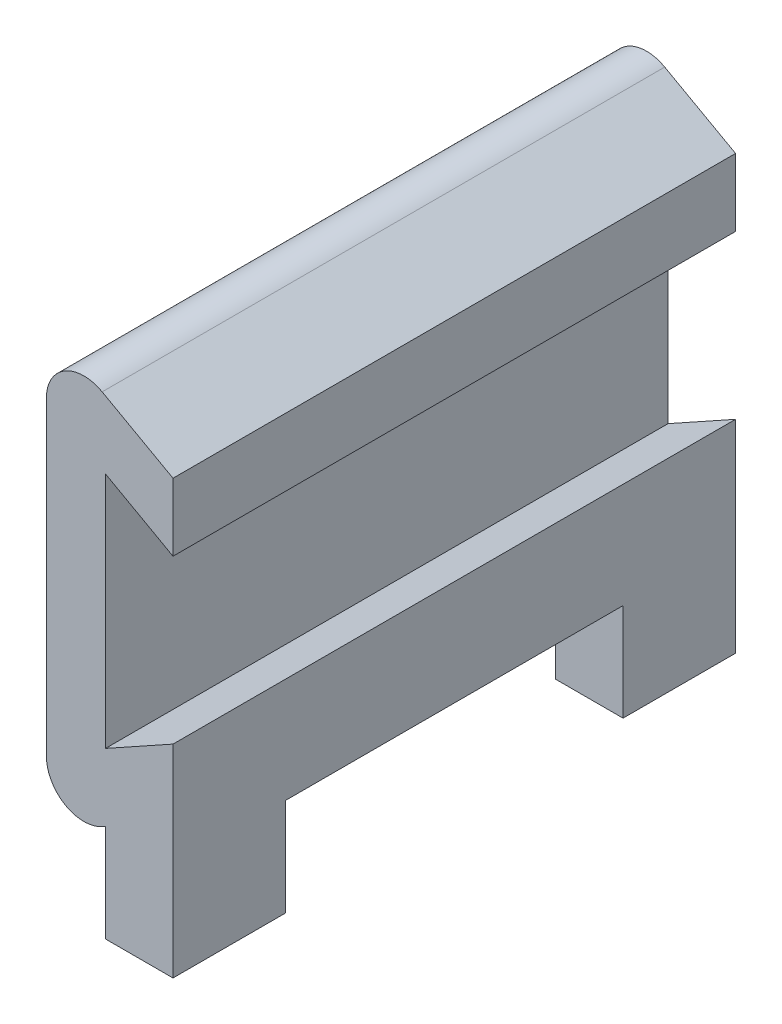
ISO-10303-21;
HEADER;
FILE_DESCRIPTION(('STEP AP214'),'2;1');
FILE_NAME('part.step','',(''),(''),'','','');
FILE_SCHEMA(('AUTOMOTIVE_DESIGN { 1 0 10303 214 1 1 1 1 }'));
ENDSEC;
DATA;
#1=APPLICATION_CONTEXT('core data for automotive mechanical design processes');
#2=APPLICATION_PROTOCOL_DEFINITION('international standard','automotive_design',2000,#1);
#3=PRODUCT_CONTEXT('',#1,'mechanical');
#4=PRODUCT('Part','Part','',(#3));
#5=PRODUCT_RELATED_PRODUCT_CATEGORY('part','',(#4));
#6=PRODUCT_DEFINITION_FORMATION('','',#4);
#7=PRODUCT_DEFINITION_CONTEXT('part definition',#1,'design');
#8=PRODUCT_DEFINITION('design','',#6,#7);
#9=PRODUCT_DEFINITION_SHAPE('','',#8);
#10=(LENGTH_UNIT() NAMED_UNIT(*) SI_UNIT(.MILLI.,.METRE.));
#11=(NAMED_UNIT(*) PLANE_ANGLE_UNIT() SI_UNIT($,.RADIAN.));
#12=(NAMED_UNIT(*) SI_UNIT($,.STERADIAN.) SOLID_ANGLE_UNIT());
#13=UNCERTAINTY_MEASURE_WITH_UNIT(LENGTH_MEASURE(1.E-05),#10,'distance_accuracy_value','');
#14=(GEOMETRIC_REPRESENTATION_CONTEXT(3) GLOBAL_UNCERTAINTY_ASSIGNED_CONTEXT((#13)) GLOBAL_UNIT_ASSIGNED_CONTEXT((#10,
#11,#12)) REPRESENTATION_CONTEXT('',''));
#15=CARTESIAN_POINT('',(0.,0.,0.));
#16=DIRECTION('',(0.,0.,1.));
#17=DIRECTION('',(1.,0.,0.));
#18=AXIS2_PLACEMENT_3D('',#15,#16,#17);
#19=CARTESIAN_POINT('',(-48.125,47.535324960837,0.));
#20=DIRECTION('',(0.,-1.,0.));
#21=DIRECTION('',(0.,0.,-1.));
#22=AXIS2_PLACEMENT_3D('',#19,#20,#21);
#23=PLANE('',#22);
#24=DIRECTION('',(-1.,0.,0.));
#25=VECTOR('',#24,1.);
#26=CARTESIAN_POINT('',(-48.125,47.535324960837,3.81));
#27=LINE('',#26,#25);
#28=CARTESIAN_POINT('',(-48.125,47.535324960837,3.81));
#29=VERTEX_POINT('',#28);
#30=CARTESIAN_POINT('',(-50.411,47.535324960837,3.81));
#31=VERTEX_POINT('',#30);
#32=EDGE_CURVE('E153',#29,#31,#27,.T.);
#33=ORIENTED_EDGE('',*,*,#32,.T.);
#34=DIRECTION('',(0.,0.,1.));
#35=VECTOR('',#34,1.);
#36=CARTESIAN_POINT('',(-50.411,47.535324960837,0.));
#37=LINE('',#36,#35);
#38=CARTESIAN_POINT('',(-50.411,47.535324960837,0.));
#39=VERTEX_POINT('',#38);
#40=EDGE_CURVE('E182',#39,#31,#37,.T.);
#41=ORIENTED_EDGE('',*,*,#40,.F.);
#42=DIRECTION('',(1.,0.,0.));
#43=VECTOR('',#42,1.);
#44=CARTESIAN_POINT('',(-48.125,47.535324960837,0.));
#45=LINE('',#44,#43);
#46=CARTESIAN_POINT('',(-48.125,47.535324960837,0.));
#47=VERTEX_POINT('',#46);
#48=EDGE_CURVE('E177',#39,#47,#45,.T.);
#49=ORIENTED_EDGE('',*,*,#48,.T.);
#50=DIRECTION('',(0.,0.,1.));
#51=VECTOR('',#50,1.);
#52=CARTESIAN_POINT('',(-48.125,47.535324960837,0.));
#53=LINE('',#52,#51);
#54=EDGE_CURVE('E169',#47,#29,#53,.T.);
#55=ORIENTED_EDGE('',*,*,#54,.T.);
#56=EDGE_LOOP('',(#33,#41,#49,#55));
#57=FACE_BOUND('',#56,.T.);
#58=ADVANCED_FACE('F39',(#57),#23,.T.);
#59=CARTESIAN_POINT('',(-50.411,52.107324960837,0.));
#60=DIRECTION('',(-1.,0.,0.));
#61=DIRECTION('',(0.,0.,1.));
#62=AXIS2_PLACEMENT_3D('',#59,#60,#61);
#63=PLANE('',#62);
#64=DIRECTION('',(0.,-1.,0.));
#65=VECTOR('',#64,1.);
#66=CARTESIAN_POINT('',(-50.411,50.837324960837,3.81));
#67=LINE('',#66,#65);
#68=CARTESIAN_POINT('',(-50.411,50.837324960837,3.81));
#69=VERTEX_POINT('',#68);
#70=EDGE_CURVE('E158',#69,#31,#67,.T.);
#71=ORIENTED_EDGE('',*,*,#70,.F.);
#72=DIRECTION('',(0.,0.,-1.));
#73=VECTOR('',#72,1.);
#74=CARTESIAN_POINT('',(-50.411,50.837324960837,19.05));
#75=LINE('',#74,#73);
#76=CARTESIAN_POINT('',(-50.411,50.837324960837,0.));
#77=VERTEX_POINT('',#76);
#78=EDGE_CURVE('E62',#69,#77,#75,.T.);
#79=ORIENTED_EDGE('',*,*,#78,.T.);
#80=DIRECTION('',(0.,-1.,0.));
#81=VECTOR('',#80,1.);
#82=CARTESIAN_POINT('',(-50.411,52.107324960837,0.));
#83=LINE('',#82,#81);
#84=EDGE_CURVE('E275',#77,#39,#83,.T.);
#85=ORIENTED_EDGE('',*,*,#84,.T.);
#86=ORIENTED_EDGE('',*,*,#40,.T.);
#87=EDGE_LOOP('',(#71,#79,#85,#86));
#88=FACE_BOUND('',#87,.T.);
#89=ADVANCED_FACE('F328',(#88),#63,.T.);
#90=CARTESIAN_POINT('',(-48.125,0.,19.05));
#91=DIRECTION('',(1.,0.,0.));
#92=DIRECTION('',(0.,0.,-1.));
#93=AXIS2_PLACEMENT_3D('',#90,#91,#92);
#94=PLANE('',#93);
#95=DIRECTION('',(0.,-1.,0.));
#96=VECTOR('',#95,1.);
#97=CARTESIAN_POINT('',(-48.125,50.837324960837,3.81));
#98=LINE('',#97,#96);
#99=CARTESIAN_POINT('',(-48.125,50.837324960837,3.81));
#100=VERTEX_POINT('',#99);
#101=EDGE_CURVE('E156',#100,#29,#98,.T.);
#102=ORIENTED_EDGE('',*,*,#101,.T.);
#103=ORIENTED_EDGE('',*,*,#54,.F.);
#104=DIRECTION('',(0.,-1.,0.));
#105=VECTOR('',#104,1.);
#106=CARTESIAN_POINT('',(-48.125,0.,0.));
#107=LINE('',#106,#105);
#108=CARTESIAN_POINT('',(-48.125,54.3952427699452,0.));
#109=VERTEX_POINT('',#108);
#110=EDGE_CURVE('E190',#109,#47,#107,.T.);
#111=ORIENTED_EDGE('',*,*,#110,.F.);
#112=DIRECTION('',(0.,0.,-1.));
#113=VECTOR('',#112,1.);
#114=CARTESIAN_POINT('',(-48.125,54.3952427699452,19.05));
#115=LINE('',#114,#113);
#116=CARTESIAN_POINT('',(-48.125,54.3952427699452,19.05));
#117=VERTEX_POINT('',#116);
#118=EDGE_CURVE('E235',#117,#109,#115,.T.);
#119=ORIENTED_EDGE('',*,*,#118,.F.);
#120=DIRECTION('',(0.,-1.,0.));
#121=VECTOR('',#120,1.);
#122=CARTESIAN_POINT('',(-48.125,0.,19.05));
#123=LINE('',#122,#121);
#124=CARTESIAN_POINT('',(-48.125,47.535324960837,19.05));
#125=VERTEX_POINT('',#124);
#126=EDGE_CURVE('E191',#117,#125,#123,.T.);
#127=ORIENTED_EDGE('',*,*,#126,.T.);
#128=CARTESIAN_POINT('',(-48.125,47.535324960837,15.24));
#129=VERTEX_POINT('',#128);
#130=EDGE_CURVE('E178',#129,#125,#53,.T.);
#131=ORIENTED_EDGE('',*,*,#130,.F.);
#132=DIRECTION('',(0.,1.,0.));
#133=VECTOR('',#132,1.);
#134=CARTESIAN_POINT('',(-48.125,50.837324960837,15.24));
#135=LINE('',#134,#133);
#136=CARTESIAN_POINT('',(-48.125,50.837324960837,15.24));
#137=VERTEX_POINT('',#136);
#138=EDGE_CURVE('E173',#129,#137,#135,.T.);
#139=ORIENTED_EDGE('',*,*,#138,.T.);
#140=DIRECTION('',(0.,0.,-1.));
#141=VECTOR('',#140,1.);
#142=CARTESIAN_POINT('',(-48.125,50.837324960837,3.81));
#143=LINE('',#142,#141);
#144=EDGE_CURVE('E163',#137,#100,#143,.T.);
#145=ORIENTED_EDGE('',*,*,#144,.T.);
#146=EDGE_LOOP('',(#102,#103,#111,#119,#127,#131,#139,#145));
#147=FACE_BOUND('',#146,.T.);
#148=ADVANCED_FACE('F167',(#147),#94,.T.);
#149=CARTESIAN_POINT('',(-34.4425558929014,61.9966006072222,19.05));
#150=DIRECTION('',(0.485642931178634,-0.874157276121537,0.));
#151=DIRECTION('',(0.874157276121537,0.485642931178634,0.));
#152=AXIS2_PLACEMENT_3D('',#149,#150,#151);
#153=PLANE('',#152);
#154=DIRECTION('',(-0.874157276121537,-0.485642931178634,0.));
#155=VECTOR('',#154,1.);
#156=CARTESIAN_POINT('',(-34.4425558929014,61.9966006072222,0.));
#157=LINE('',#156,#155);
#158=CARTESIAN_POINT('',(-50.411,53.1252427699452,0.));
#159=VERTEX_POINT('',#158);
#160=EDGE_CURVE('E211',#109,#159,#157,.T.);
#161=ORIENTED_EDGE('',*,*,#160,.T.);
#162=DIRECTION('',(0.,0.,-1.));
#163=VECTOR('',#162,1.);
#164=CARTESIAN_POINT('',(-50.411,53.1252427699452,19.05));
#165=LINE('',#164,#163);
#166=CARTESIAN_POINT('',(-50.411,53.1252427699452,19.05));
#167=VERTEX_POINT('',#166);
#168=EDGE_CURVE('E232',#167,#159,#165,.T.);
#169=ORIENTED_EDGE('',*,*,#168,.F.);
#170=DIRECTION('',(-0.874157276121537,-0.485642931178634,0.));
#171=VECTOR('',#170,1.);
#172=CARTESIAN_POINT('',(-34.4425558929014,61.9966006072222,19.05));
#173=LINE('',#172,#171);
#174=EDGE_CURVE('E194',#117,#167,#173,.T.);
#175=ORIENTED_EDGE('',*,*,#174,.F.);
#176=ORIENTED_EDGE('',*,*,#118,.T.);
#177=EDGE_LOOP('',(#161,#169,#175,#176));
#178=FACE_BOUND('',#177,.T.);
#179=ADVANCED_FACE('F297',(#178),#153,.F.);
#180=CARTESIAN_POINT('',(-50.411,0.,19.05));
#181=DIRECTION('',(-1.,0.,0.));
#182=DIRECTION('',(0.,0.,1.));
#183=AXIS2_PLACEMENT_3D('',#180,#181,#182);
#184=PLANE('',#183);
#185=DIRECTION('',(0.,1.,0.));
#186=VECTOR('',#185,1.);
#187=CARTESIAN_POINT('',(-50.411,0.,0.));
#188=LINE('',#187,#186);
#189=CARTESIAN_POINT('',(-50.411,61.1747572300548,0.));
#190=VERTEX_POINT('',#189);
#191=EDGE_CURVE('E214',#159,#190,#188,.T.);
#192=ORIENTED_EDGE('',*,*,#191,.T.);
#193=DIRECTION('',(0.,0.,-1.));
#194=VECTOR('',#193,1.);
#195=CARTESIAN_POINT('',(-50.411,61.1747572300548,19.05));
#196=LINE('',#195,#194);
#197=CARTESIAN_POINT('',(-50.411,61.1747572300548,19.05));
#198=VERTEX_POINT('',#197);
#199=EDGE_CURVE('E229',#198,#190,#196,.T.);
#200=ORIENTED_EDGE('',*,*,#199,.F.);
#201=DIRECTION('',(0.,1.,0.));
#202=VECTOR('',#201,1.);
#203=CARTESIAN_POINT('',(-50.411,0.,19.05));
#204=LINE('',#203,#202);
#205=EDGE_CURVE('E198',#167,#198,#204,.T.);
#206=ORIENTED_EDGE('',*,*,#205,.F.);
#207=ORIENTED_EDGE('',*,*,#168,.T.);
#208=EDGE_LOOP('',(#192,#200,#206,#207));
#209=FACE_BOUND('',#208,.T.);
#210=ADVANCED_FACE('F302',(#209),#184,.F.);
#211=CARTESIAN_POINT('',(14.0810290127591,25.3458522229663,19.05));
#212=DIRECTION('',(0.485642931178634,0.874157276121537,0.));
#213=DIRECTION('',(-0.874157276121537,0.485642931178634,0.));
#214=AXIS2_PLACEMENT_3D('',#211,#212,#213);
#215=PLANE('',#214);
#216=DIRECTION('',(0.874157276121537,-0.485642931178634,0.));
#217=VECTOR('',#216,1.);
#218=CARTESIAN_POINT('',(14.0810290127591,25.3458522229663,0.));
#219=LINE('',#218,#217);
#220=CARTESIAN_POINT('',(-48.125,59.9047572300548,0.));
#221=VERTEX_POINT('',#220);
#222=EDGE_CURVE('E216',#190,#221,#219,.T.);
#223=ORIENTED_EDGE('',*,*,#222,.T.);
#224=DIRECTION('',(0.,0.,-1.));
#225=VECTOR('',#224,1.);
#226=CARTESIAN_POINT('',(-48.125,59.9047572300548,19.05));
#227=LINE('',#226,#225);
#228=CARTESIAN_POINT('',(-48.125,59.9047572300548,19.05));
#229=VERTEX_POINT('',#228);
#230=EDGE_CURVE('E227',#229,#221,#227,.T.);
#231=ORIENTED_EDGE('',*,*,#230,.F.);
#232=DIRECTION('',(0.874157276121537,-0.485642931178634,0.));
#233=VECTOR('',#232,1.);
#234=CARTESIAN_POINT('',(14.0810290127591,25.3458522229663,19.05));
#235=LINE('',#234,#233);
#236=EDGE_CURVE('E200',#198,#229,#235,.T.);
#237=ORIENTED_EDGE('',*,*,#236,.F.);
#238=ORIENTED_EDGE('',*,*,#199,.T.);
#239=EDGE_LOOP('',(#223,#231,#237,#238));
#240=FACE_BOUND('',#239,.T.);
#241=ADVANCED_FACE('F309',(#240),#215,.F.);
#242=CARTESIAN_POINT('',(-48.125,62.1926750391631,0.));
#243=VERTEX_POINT('',#242);
#244=EDGE_CURVE('E212',#243,#221,#107,.T.);
#245=ORIENTED_EDGE('',*,*,#244,.F.);
#246=DIRECTION('',(0.,0.,-1.));
#247=VECTOR('',#246,1.);
#248=CARTESIAN_POINT('',(-48.125,62.1926750391631,19.05));
#249=LINE('',#248,#247);
#250=CARTESIAN_POINT('',(-48.125,62.1926750391631,19.05));
#251=VERTEX_POINT('',#250);
#252=EDGE_CURVE('E209',#251,#243,#249,.T.);
#253=ORIENTED_EDGE('',*,*,#252,.F.);
#254=EDGE_CURVE('E196',#251,#229,#123,.T.);
#255=ORIENTED_EDGE('',*,*,#254,.T.);
#256=ORIENTED_EDGE('',*,*,#230,.T.);
#257=EDGE_LOOP('',(#245,#253,#255,#256));
#258=FACE_BOUND('',#257,.T.);
#259=ADVANCED_FACE('F315',(#258),#94,.T.);
#260=CARTESIAN_POINT('',(15.0523148751164,27.0941667752094,19.05));
#261=DIRECTION('',(0.485642931178634,0.874157276121537,0.));
#262=DIRECTION('',(-0.874157276121537,0.485642931178634,0.));
#263=AXIS2_PLACEMENT_3D('',#260,#261,#262);
#264=PLANE('',#263);
#265=DIRECTION('',(0.874157276121537,-0.485642931178634,0.));
#266=VECTOR('',#265,1.);
#267=CARTESIAN_POINT('',(15.0523148751164,27.0941667752094,0.));
#268=LINE('',#267,#266);
#269=CARTESIAN_POINT('',(-50.5242334774032,63.5255825266093,0.));
#270=VERTEX_POINT('',#269);
#271=EDGE_CURVE('E219',#270,#243,#268,.T.);
#272=ORIENTED_EDGE('',*,*,#271,.F.);
#273=DIRECTION('',(0.,0.,-1.));
#274=VECTOR('',#273,1.);
#275=CARTESIAN_POINT('',(-50.5242334774031,63.5255825266093,19.05));
#276=LINE('',#275,#274);
#277=CARTESIAN_POINT('',(-50.5242334774032,63.5255825266093,19.05));
#278=VERTEX_POINT('',#277);
#279=EDGE_CURVE('E11',#270,#278,#276,.F.);
#280=ORIENTED_EDGE('',*,*,#279,.T.);
#281=DIRECTION('',(0.874157276121537,-0.485642931178634,0.));
#282=VECTOR('',#281,1.);
#283=CARTESIAN_POINT('',(15.0523148751164,27.0941667752094,19.05));
#284=LINE('',#283,#282);
#285=EDGE_CURVE('E202',#278,#251,#284,.T.);
#286=ORIENTED_EDGE('',*,*,#285,.T.);
#287=ORIENTED_EDGE('',*,*,#252,.T.);
#288=EDGE_LOOP('',(#272,#280,#286,#287));
#289=FACE_BOUND('',#288,.T.);
#290=ADVANCED_FACE('F318',(#289),#264,.T.);
#291=CARTESIAN_POINT('',(-52.411,0.,19.05));
#292=DIRECTION('',(-1.,0.,0.));
#293=DIRECTION('',(0.,0.,1.));
#294=AXIS2_PLACEMENT_3D('',#291,#292,#293);
#295=PLANE('',#294);
#296=DIRECTION('',(0.,1.,0.));
#297=VECTOR('',#296,1.);
#298=CARTESIAN_POINT('',(-52.411,0.,0.));
#299=LINE('',#298,#297);
#300=CARTESIAN_POINT('',(-52.411,51.8845972140651,0.));
#301=VERTEX_POINT('',#300);
#302=CARTESIAN_POINT('',(-52.411,62.4154027859349,0.));
#303=VERTEX_POINT('',#302);
#304=EDGE_CURVE('E221',#301,#303,#299,.T.);
#305=ORIENTED_EDGE('',*,*,#304,.F.);
#306=DIRECTION('',(0.,0.,-1.));
#307=VECTOR('',#306,1.);
#308=CARTESIAN_POINT('',(-52.411,51.8845972140651,19.05));
#309=LINE('',#308,#307);
#310=CARTESIAN_POINT('',(-52.411,51.8845972140651,19.05));
#311=VERTEX_POINT('',#310);
#312=EDGE_CURVE('E247',#301,#311,#309,.F.);
#313=ORIENTED_EDGE('',*,*,#312,.T.);
#314=DIRECTION('',(0.,1.,0.));
#315=VECTOR('',#314,1.);
#316=CARTESIAN_POINT('',(-52.411,0.,19.05));
#317=LINE('',#316,#315);
#318=CARTESIAN_POINT('',(-52.411,62.4154027859349,19.05));
#319=VERTEX_POINT('',#318);
#320=EDGE_CURVE('E204',#311,#319,#317,.T.);
#321=ORIENTED_EDGE('',*,*,#320,.T.);
#322=DIRECTION('',(0.,0.,-1.));
#323=VECTOR('',#322,1.);
#324=CARTESIAN_POINT('',(-52.411,62.4154027859349,19.05));
#325=LINE('',#324,#323);
#326=EDGE_CURVE('E244',#319,#303,#325,.T.);
#327=ORIENTED_EDGE('',*,*,#326,.T.);
#328=EDGE_LOOP('',(#305,#313,#321,#327));
#329=FACE_BOUND('',#328,.T.);
#330=ADVANCED_FACE('F325',(#329),#295,.T.);
#331=CARTESIAN_POINT('',(-33.4712700305441,60.2482860549792,19.05));
#332=DIRECTION('',(0.485642931178633,-0.874157276121537,0.));
#333=DIRECTION('',(0.874157276121537,0.485642931178633,0.));
#334=AXIS2_PLACEMENT_3D('',#331,#332,#333);
#335=PLANE('',#334);
#336=CARTESIAN_POINT('',(-50.411,50.837324960837,19.05));
#337=VERTEX_POINT('',#336);
#338=CARTESIAN_POINT('',(-50.411,50.837324960837,15.24));
#339=VERTEX_POINT('',#338);
#340=EDGE_CURVE('E180',#337,#339,#75,.T.);
#341=ORIENTED_EDGE('',*,*,#340,.F.);
#342=DIRECTION('',(-0.874157276121537,-0.485642931178633,0.));
#343=VECTOR('',#342,1.);
#344=CARTESIAN_POINT('',(-33.4712700305441,60.2482860549792,19.05));
#345=LINE('',#344,#343);
#346=CARTESIAN_POINT('',(-50.5242334774031,50.7744174733908,19.05));
#347=VERTEX_POINT('',#346);
#348=EDGE_CURVE('E207',#337,#347,#345,.T.);
#349=ORIENTED_EDGE('',*,*,#348,.T.);
#350=DIRECTION('',(0.,0.,-1.));
#351=VECTOR('',#350,1.);
#352=CARTESIAN_POINT('',(-50.5242334774031,50.7744174733908,19.05));
#353=LINE('',#352,#351);
#354=CARTESIAN_POINT('',(-50.5242334774031,50.7744174733908,0.));
#355=VERTEX_POINT('',#354);
#356=EDGE_CURVE('E237',#347,#355,#353,.T.);
#357=ORIENTED_EDGE('',*,*,#356,.T.);
#358=DIRECTION('',(-0.874157276121537,-0.485642931178633,0.));
#359=VECTOR('',#358,1.);
#360=CARTESIAN_POINT('',(-33.4712700305441,60.2482860549792,0.));
#361=LINE('',#360,#359);
#362=EDGE_CURVE('E195',#77,#355,#361,.T.);
#363=ORIENTED_EDGE('',*,*,#362,.F.);
#364=ORIENTED_EDGE('',*,*,#78,.F.);
#365=DIRECTION('',(0.,0.,-1.));
#366=VECTOR('',#365,1.);
#367=CARTESIAN_POINT('',(-50.411,50.837324960837,3.81));
#368=LINE('',#367,#366);
#369=EDGE_CURVE('E174',#339,#69,#368,.T.);
#370=ORIENTED_EDGE('',*,*,#369,.F.);
#371=EDGE_LOOP('',(#341,#349,#357,#363,#364,#370));
#372=FACE_BOUND('',#371,.T.);
#373=ADVANCED_FACE('F263',(#372),#335,.T.);
#374=CARTESIAN_POINT('',(0.,0.,19.05));
#375=DIRECTION('',(0.,0.,1.));
#376=DIRECTION('',(1.,0.,0.));
#377=AXIS2_PLACEMENT_3D('',#374,#375,#376);
#378=PLANE('',#377);
#379=ORIENTED_EDGE('',*,*,#348,.F.);
#380=DIRECTION('',(0.,-1.,0.));
#381=VECTOR('',#380,1.);
#382=CARTESIAN_POINT('',(-50.411,52.107324960837,19.05));
#383=LINE('',#382,#381);
#384=CARTESIAN_POINT('',(-50.411,47.535324960837,19.05));
#385=VERTEX_POINT('',#384);
#386=EDGE_CURVE('E269',#337,#385,#383,.T.);
#387=ORIENTED_EDGE('',*,*,#386,.T.);
#388=DIRECTION('',(1.,0.,0.));
#389=VECTOR('',#388,1.);
#390=CARTESIAN_POINT('',(-48.125,47.535324960837,19.05));
#391=LINE('',#390,#389);
#392=EDGE_CURVE('E185',#385,#125,#391,.T.);
#393=ORIENTED_EDGE('',*,*,#392,.T.);
#394=ORIENTED_EDGE('',*,*,#126,.F.);
#395=ORIENTED_EDGE('',*,*,#174,.T.);
#396=ORIENTED_EDGE('',*,*,#205,.T.);
#397=ORIENTED_EDGE('',*,*,#236,.T.);
#398=ORIENTED_EDGE('',*,*,#254,.F.);
#399=ORIENTED_EDGE('',*,*,#285,.F.);
#400=CARTESIAN_POINT('',(-51.141,62.4154027859349,19.05));
#401=DIRECTION('',(0.,0.,1.));
#402=DIRECTION('',(1.,0.,0.));
#403=AXIS2_PLACEMENT_3D('',#400,#401,#402);
#404=CIRCLE('',#403,1.27);
#405=EDGE_CURVE('E249',#278,#319,#404,.T.);
#406=ORIENTED_EDGE('',*,*,#405,.T.);
#407=ORIENTED_EDGE('',*,*,#320,.F.);
#408=CARTESIAN_POINT('',(-51.141,51.8845972140651,19.05));
#409=DIRECTION('',(0.,0.,1.));
#410=DIRECTION('',(1.,0.,0.));
#411=AXIS2_PLACEMENT_3D('',#408,#409,#410);
#412=CIRCLE('',#411,1.27);
#413=EDGE_CURVE('E47',#311,#347,#412,.T.);
#414=ORIENTED_EDGE('',*,*,#413,.T.);
#415=EDGE_LOOP('',(#379,#387,#393,#394,#395,#396,#397,#398,#399,#406,#407,#414));
#416=FACE_BOUND('',#415,.T.);
#417=ADVANCED_FACE('F255',(#416),#378,.T.);
#418=CARTESIAN_POINT('',(0.,0.,0.));
#419=DIRECTION('',(0.,0.,1.));
#420=DIRECTION('',(1.,0.,0.));
#421=AXIS2_PLACEMENT_3D('',#418,#419,#420);
#422=PLANE('',#421);
#423=ORIENTED_EDGE('',*,*,#110,.T.);
#424=ORIENTED_EDGE('',*,*,#48,.F.);
#425=ORIENTED_EDGE('',*,*,#84,.F.);
#426=ORIENTED_EDGE('',*,*,#362,.T.);
#427=CARTESIAN_POINT('',(-51.141,51.8845972140651,0.));
#428=DIRECTION('',(0.,0.,1.));
#429=DIRECTION('',(1.,0.,0.));
#430=AXIS2_PLACEMENT_3D('',#427,#428,#429);
#431=CIRCLE('',#430,1.27);
#432=EDGE_CURVE('E242',#355,#301,#431,.F.);
#433=ORIENTED_EDGE('',*,*,#432,.T.);
#434=ORIENTED_EDGE('',*,*,#304,.T.);
#435=CARTESIAN_POINT('',(-51.141,62.4154027859349,0.));
#436=DIRECTION('',(0.,0.,1.));
#437=DIRECTION('',(1.,0.,0.));
#438=AXIS2_PLACEMENT_3D('',#435,#436,#437);
#439=CIRCLE('',#438,1.27);
#440=EDGE_CURVE('E240',#303,#270,#439,.F.);
#441=ORIENTED_EDGE('',*,*,#440,.T.);
#442=ORIENTED_EDGE('',*,*,#271,.T.);
#443=ORIENTED_EDGE('',*,*,#244,.T.);
#444=ORIENTED_EDGE('',*,*,#222,.F.);
#445=ORIENTED_EDGE('',*,*,#191,.F.);
#446=ORIENTED_EDGE('',*,*,#160,.F.);
#447=EDGE_LOOP('',(#423,#424,#425,#426,#433,#434,#441,#442,#443,#444,#445,#446));
#448=FACE_BOUND('',#447,.T.);
#449=ADVANCED_FACE('F327',(#448),#422,.F.);
#450=CARTESIAN_POINT('',(-51.141,51.8845972140651,19.05));
#451=DIRECTION('',(0.,0.,-1.));
#452=DIRECTION('',(-1.,0.,0.));
#453=AXIS2_PLACEMENT_3D('',#450,#451,#452);
#454=CYLINDRICAL_SURFACE('',#453,1.27);
#455=ORIENTED_EDGE('',*,*,#413,.F.);
#456=ORIENTED_EDGE('',*,*,#312,.F.);
#457=ORIENTED_EDGE('',*,*,#432,.F.);
#458=ORIENTED_EDGE('',*,*,#356,.F.);
#459=EDGE_LOOP('',(#455,#456,#457,#458));
#460=FACE_BOUND('',#459,.T.);
#461=ADVANCED_FACE('F261',(#460),#454,.T.);
#462=CARTESIAN_POINT('',(-51.141,62.4154027859349,19.05));
#463=DIRECTION('',(0.,0.,-1.));
#464=DIRECTION('',(-1.,0.,0.));
#465=AXIS2_PLACEMENT_3D('',#462,#463,#464);
#466=CYLINDRICAL_SURFACE('',#465,1.27);
#467=ORIENTED_EDGE('',*,*,#405,.F.);
#468=ORIENTED_EDGE('',*,*,#279,.F.);
#469=ORIENTED_EDGE('',*,*,#440,.F.);
#470=ORIENTED_EDGE('',*,*,#326,.F.);
#471=EDGE_LOOP('',(#467,#468,#469,#470));
#472=FACE_BOUND('',#471,.T.);
#473=ADVANCED_FACE('F41',(#472),#466,.T.);
#474=DIRECTION('',(-1.,0.,0.));
#475=VECTOR('',#474,1.);
#476=CARTESIAN_POINT('',(-48.125,47.535324960837,15.24));
#477=LINE('',#476,#475);
#478=CARTESIAN_POINT('',(-50.411,47.535324960837,15.24));
#479=VERTEX_POINT('',#478);
#480=EDGE_CURVE('E54',#129,#479,#477,.T.);
#481=ORIENTED_EDGE('',*,*,#480,.F.);
#482=ORIENTED_EDGE('',*,*,#130,.T.);
#483=ORIENTED_EDGE('',*,*,#392,.F.);
#484=EDGE_CURVE('E187',#479,#385,#37,.T.);
#485=ORIENTED_EDGE('',*,*,#484,.F.);
#486=EDGE_LOOP('',(#481,#482,#483,#485));
#487=FACE_BOUND('',#486,.T.);
#488=ADVANCED_FACE('F291',(#487),#23,.T.);
#489=DIRECTION('',(0.,1.,0.));
#490=VECTOR('',#489,1.);
#491=CARTESIAN_POINT('',(-50.411,50.837324960837,15.24));
#492=LINE('',#491,#490);
#493=EDGE_CURVE('E284',#479,#339,#492,.T.);
#494=ORIENTED_EDGE('',*,*,#493,.F.);
#495=ORIENTED_EDGE('',*,*,#484,.T.);
#496=ORIENTED_EDGE('',*,*,#386,.F.);
#497=ORIENTED_EDGE('',*,*,#340,.T.);
#498=EDGE_LOOP('',(#494,#495,#496,#497));
#499=FACE_BOUND('',#498,.T.);
#500=ADVANCED_FACE('F270',(#499),#63,.T.);
#501=CARTESIAN_POINT('',(-48.125,50.837324960837,3.81));
#502=DIRECTION('',(0.,0.,-1.));
#503=DIRECTION('',(0.,1.,0.));
#504=AXIS2_PLACEMENT_3D('',#501,#502,#503);
#505=PLANE('',#504);
#506=ORIENTED_EDGE('',*,*,#70,.T.);
#507=ORIENTED_EDGE('',*,*,#32,.F.);
#508=ORIENTED_EDGE('',*,*,#101,.F.);
#509=DIRECTION('',(-1.,0.,0.));
#510=VECTOR('',#509,1.);
#511=CARTESIAN_POINT('',(-48.125,50.837324960837,3.81));
#512=LINE('',#511,#510);
#513=EDGE_CURVE('E274',#100,#69,#512,.T.);
#514=ORIENTED_EDGE('',*,*,#513,.T.);
#515=EDGE_LOOP('',(#506,#507,#508,#514));
#516=FACE_BOUND('',#515,.T.);
#517=ADVANCED_FACE('F155',(#516),#505,.F.);
#518=CARTESIAN_POINT('',(-48.125,50.837324960837,3.81));
#519=DIRECTION('',(0.,1.,0.));
#520=DIRECTION('',(0.,0.,1.));
#521=AXIS2_PLACEMENT_3D('',#518,#519,#520);
#522=PLANE('',#521);
#523=ORIENTED_EDGE('',*,*,#369,.T.);
#524=ORIENTED_EDGE('',*,*,#513,.F.);
#525=ORIENTED_EDGE('',*,*,#144,.F.);
#526=DIRECTION('',(-1.,0.,0.));
#527=VECTOR('',#526,1.);
#528=CARTESIAN_POINT('',(-48.125,50.837324960837,15.24));
#529=LINE('',#528,#527);
#530=EDGE_CURVE('E276',#137,#339,#529,.T.);
#531=ORIENTED_EDGE('',*,*,#530,.T.);
#532=EDGE_LOOP('',(#523,#524,#525,#531));
#533=FACE_BOUND('',#532,.T.);
#534=ADVANCED_FACE('F343',(#533),#522,.F.);
#535=CARTESIAN_POINT('',(-48.125,50.837324960837,15.24));
#536=DIRECTION('',(0.,0.,1.));
#537=DIRECTION('',(1.,0.,0.));
#538=AXIS2_PLACEMENT_3D('',#535,#536,#537);
#539=PLANE('',#538);
#540=ORIENTED_EDGE('',*,*,#493,.T.);
#541=ORIENTED_EDGE('',*,*,#530,.F.);
#542=ORIENTED_EDGE('',*,*,#138,.F.);
#543=ORIENTED_EDGE('',*,*,#480,.T.);
#544=EDGE_LOOP('',(#540,#541,#542,#543));
#545=FACE_BOUND('',#544,.T.);
#546=ADVANCED_FACE('F289',(#545),#539,.F.);
#547=CLOSED_SHELL('',(#58,#89,#148,#179,#210,#241,#259,#290,#330,#373,#417,#449,#461,#473,#488,
#500,#517,#534,#546));
#548=MANIFOLD_SOLID_BREP('B2',#547);
#549=ADVANCED_BREP_SHAPE_REPRESENTATION('',(#18,#548),#14);
#550=SHAPE_DEFINITION_REPRESENTATION(#9,#549);
ENDSEC;
END-ISO-10303-21;
